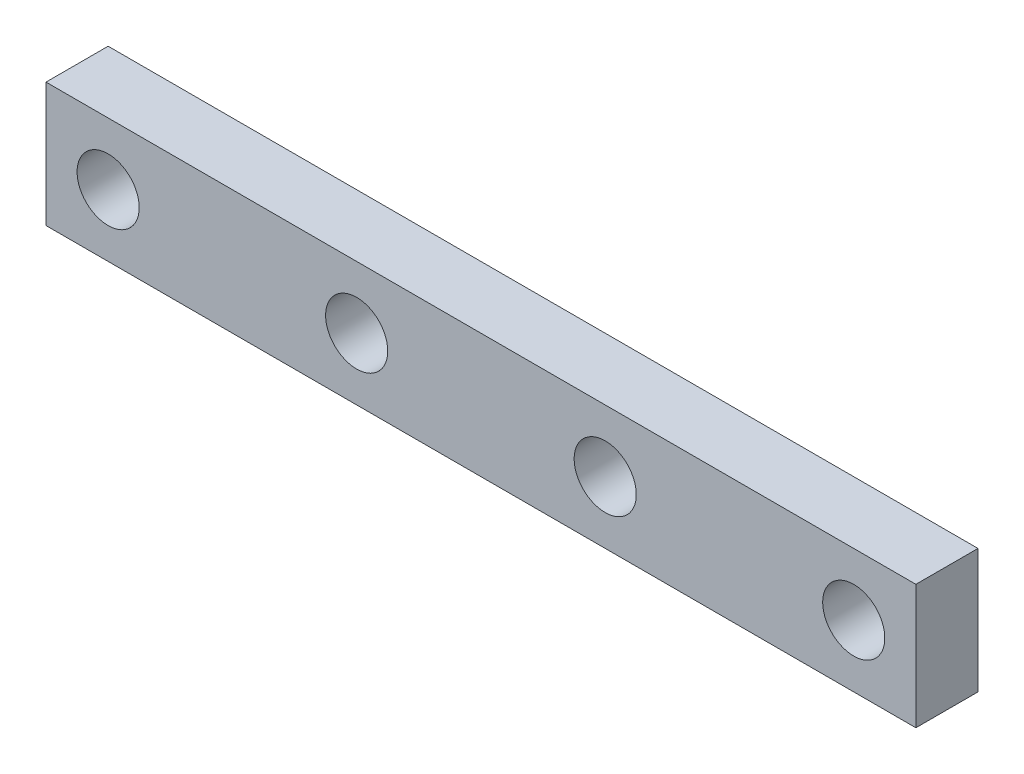
ISO-10303-21;
HEADER;
FILE_DESCRIPTION(('STEP AP214'),'2;1');
FILE_NAME('part.step','',(''),(''),'','','');
FILE_SCHEMA(('AUTOMOTIVE_DESIGN { 1 0 10303 214 1 1 1 1 }'));
ENDSEC;
DATA;
#1=APPLICATION_CONTEXT('core data for automotive mechanical design processes');
#2=APPLICATION_PROTOCOL_DEFINITION('international standard','automotive_design',2000,#1);
#3=PRODUCT_CONTEXT('',#1,'mechanical');
#4=PRODUCT('Part','Part','',(#3));
#5=PRODUCT_RELATED_PRODUCT_CATEGORY('part','',(#4));
#6=PRODUCT_DEFINITION_FORMATION('','',#4);
#7=PRODUCT_DEFINITION_CONTEXT('part definition',#1,'design');
#8=PRODUCT_DEFINITION('design','',#6,#7);
#9=PRODUCT_DEFINITION_SHAPE('','',#8);
#10=(LENGTH_UNIT() NAMED_UNIT(*) SI_UNIT(.MILLI.,.METRE.));
#11=(NAMED_UNIT(*) PLANE_ANGLE_UNIT() SI_UNIT($,.RADIAN.));
#12=(NAMED_UNIT(*) SI_UNIT($,.STERADIAN.) SOLID_ANGLE_UNIT());
#13=UNCERTAINTY_MEASURE_WITH_UNIT(LENGTH_MEASURE(1.E-05),#10,'distance_accuracy_value','');
#14=(GEOMETRIC_REPRESENTATION_CONTEXT(3) GLOBAL_UNCERTAINTY_ASSIGNED_CONTEXT((#13)) GLOBAL_UNIT_ASSIGNED_CONTEXT((#10,
#11,#12)) REPRESENTATION_CONTEXT('',''));
#15=CARTESIAN_POINT('',(0.,0.,0.));
#16=DIRECTION('',(0.,0.,1.));
#17=DIRECTION('',(1.,0.,0.));
#18=AXIS2_PLACEMENT_3D('',#15,#16,#17);
#19=CARTESIAN_POINT('',(22.225,-3.175,3.175));
#20=DIRECTION('',(-1.,0.,0.));
#21=DIRECTION('',(0.,0.,1.));
#22=AXIS2_PLACEMENT_3D('',#19,#20,#21);
#23=PLANE('',#22);
#24=DIRECTION('',(0.,1.,0.));
#25=VECTOR('',#24,1.);
#26=CARTESIAN_POINT('',(22.225,-3.175,0.));
#27=LINE('',#26,#25);
#28=CARTESIAN_POINT('',(22.225,-3.175,0.));
#29=VERTEX_POINT('',#28);
#30=CARTESIAN_POINT('',(22.225,3.175,0.));
#31=VERTEX_POINT('',#30);
#32=EDGE_CURVE('E111',#29,#31,#27,.T.);
#33=ORIENTED_EDGE('',*,*,#32,.T.);
#34=DIRECTION('',(0.,0.,-1.));
#35=VECTOR('',#34,1.);
#36=CARTESIAN_POINT('',(22.225,3.175,3.175));
#37=LINE('',#36,#35);
#38=CARTESIAN_POINT('',(22.225,3.175,3.175));
#39=VERTEX_POINT('',#38);
#40=EDGE_CURVE('E11',#39,#31,#37,.T.);
#41=ORIENTED_EDGE('',*,*,#40,.F.);
#42=DIRECTION('',(0.,1.,0.));
#43=VECTOR('',#42,1.);
#44=CARTESIAN_POINT('',(22.225,-3.175,3.175));
#45=LINE('',#44,#43);
#46=CARTESIAN_POINT('',(22.225,-3.175,3.175));
#47=VERTEX_POINT('',#46);
#48=EDGE_CURVE('E95',#47,#39,#45,.T.);
#49=ORIENTED_EDGE('',*,*,#48,.F.);
#50=DIRECTION('',(0.,0.,-1.));
#51=VECTOR('',#50,1.);
#52=CARTESIAN_POINT('',(22.225,-3.175,3.175));
#53=LINE('',#52,#51);
#54=EDGE_CURVE('E107',#47,#29,#53,.T.);
#55=ORIENTED_EDGE('',*,*,#54,.T.);
#56=EDGE_LOOP('',(#33,#41,#49,#55));
#57=FACE_BOUND('',#56,.T.);
#58=ADVANCED_FACE('F43',(#57),#23,.F.);
#59=CARTESIAN_POINT('',(-22.225,3.175,3.175));
#60=DIRECTION('',(0.,-1.,0.));
#61=DIRECTION('',(0.,0.,-1.));
#62=AXIS2_PLACEMENT_3D('',#59,#60,#61);
#63=PLANE('',#62);
#64=DIRECTION('',(-1.,0.,0.));
#65=VECTOR('',#64,1.);
#66=CARTESIAN_POINT('',(-22.225,3.175,0.));
#67=LINE('',#66,#65);
#68=CARTESIAN_POINT('',(-22.225,3.175,0.));
#69=VERTEX_POINT('',#68);
#70=EDGE_CURVE('E100',#31,#69,#67,.T.);
#71=ORIENTED_EDGE('',*,*,#70,.T.);
#72=DIRECTION('',(0.,0.,-1.));
#73=VECTOR('',#72,1.);
#74=CARTESIAN_POINT('',(-22.225,3.175,3.175));
#75=LINE('',#74,#73);
#76=CARTESIAN_POINT('',(-22.225,3.175,3.175));
#77=VERTEX_POINT('',#76);
#78=EDGE_CURVE('E52',#77,#69,#75,.T.);
#79=ORIENTED_EDGE('',*,*,#78,.F.);
#80=DIRECTION('',(-1.,0.,0.));
#81=VECTOR('',#80,1.);
#82=CARTESIAN_POINT('',(-22.225,3.175,3.175));
#83=LINE('',#82,#81);
#84=EDGE_CURVE('E90',#39,#77,#83,.T.);
#85=ORIENTED_EDGE('',*,*,#84,.F.);
#86=ORIENTED_EDGE('',*,*,#40,.T.);
#87=EDGE_LOOP('',(#71,#79,#85,#86));
#88=FACE_BOUND('',#87,.T.);
#89=ADVANCED_FACE('F99',(#88),#63,.F.);
#90=CARTESIAN_POINT('',(-22.225,-3.175,3.175));
#91=DIRECTION('',(1.,0.,0.));
#92=DIRECTION('',(0.,0.,-1.));
#93=AXIS2_PLACEMENT_3D('',#90,#91,#92);
#94=PLANE('',#93);
#95=DIRECTION('',(0.,-1.,0.));
#96=VECTOR('',#95,1.);
#97=CARTESIAN_POINT('',(-22.225,-3.175,0.));
#98=LINE('',#97,#96);
#99=CARTESIAN_POINT('',(-22.225,-3.175,0.));
#100=VERTEX_POINT('',#99);
#101=EDGE_CURVE('E77',#69,#100,#98,.T.);
#102=ORIENTED_EDGE('',*,*,#101,.T.);
#103=DIRECTION('',(0.,0.,-1.));
#104=VECTOR('',#103,1.);
#105=CARTESIAN_POINT('',(-22.225,-3.175,3.175));
#106=LINE('',#105,#104);
#107=CARTESIAN_POINT('',(-22.225,-3.175,3.175));
#108=VERTEX_POINT('',#107);
#109=EDGE_CURVE('E102',#108,#100,#106,.T.);
#110=ORIENTED_EDGE('',*,*,#109,.F.);
#111=DIRECTION('',(0.,-1.,0.));
#112=VECTOR('',#111,1.);
#113=CARTESIAN_POINT('',(-22.225,-3.175,3.175));
#114=LINE('',#113,#112);
#115=EDGE_CURVE('E93',#77,#108,#114,.T.);
#116=ORIENTED_EDGE('',*,*,#115,.F.);
#117=ORIENTED_EDGE('',*,*,#78,.T.);
#118=EDGE_LOOP('',(#102,#110,#116,#117));
#119=FACE_BOUND('',#118,.T.);
#120=ADVANCED_FACE('F103',(#119),#94,.F.);
#121=CARTESIAN_POINT('',(-22.225,-3.175,3.175));
#122=DIRECTION('',(0.,1.,0.));
#123=DIRECTION('',(0.,0.,1.));
#124=AXIS2_PLACEMENT_3D('',#121,#122,#123);
#125=PLANE('',#124);
#126=DIRECTION('',(1.,0.,0.));
#127=VECTOR('',#126,1.);
#128=CARTESIAN_POINT('',(-22.225,-3.175,0.));
#129=LINE('',#128,#127);
#130=EDGE_CURVE('E83',#100,#29,#129,.T.);
#131=ORIENTED_EDGE('',*,*,#130,.T.);
#132=ORIENTED_EDGE('',*,*,#54,.F.);
#133=DIRECTION('',(1.,0.,0.));
#134=VECTOR('',#133,1.);
#135=CARTESIAN_POINT('',(-22.225,-3.175,3.175));
#136=LINE('',#135,#134);
#137=EDGE_CURVE('E60',#108,#47,#136,.T.);
#138=ORIENTED_EDGE('',*,*,#137,.F.);
#139=ORIENTED_EDGE('',*,*,#109,.T.);
#140=EDGE_LOOP('',(#131,#132,#138,#139));
#141=FACE_BOUND('',#140,.T.);
#142=ADVANCED_FACE('F125',(#141),#125,.F.);
#143=CARTESIAN_POINT('',(0.,0.,3.175));
#144=DIRECTION('',(0.,0.,-1.));
#145=DIRECTION('',(-1.,0.,0.));
#146=AXIS2_PLACEMENT_3D('',#143,#144,#145);
#147=PLANE('',#146);
#148=CARTESIAN_POINT('',(6.35,0.,3.175));
#149=DIRECTION('',(0.,0.,-1.));
#150=DIRECTION('',(-1.,0.,0.));
#151=AXIS2_PLACEMENT_3D('',#148,#149,#150);
#152=CIRCLE('',#151,1.5875);
#153=CARTESIAN_POINT('',(4.7625,0.,3.175));
#154=VERTEX_POINT('',#153);
#155=EDGE_CURVE('E156',#154,#154,#152,.T.);
#156=ORIENTED_EDGE('',*,*,#155,.T.);
#157=EDGE_LOOP('',(#156));
#158=FACE_BOUND('',#157,.T.);
#159=CARTESIAN_POINT('',(19.05,0.,3.175));
#160=DIRECTION('',(0.,0.,-1.));
#161=DIRECTION('',(-1.,0.,0.));
#162=AXIS2_PLACEMENT_3D('',#159,#160,#161);
#163=CIRCLE('',#162,1.5875);
#164=CARTESIAN_POINT('',(17.4625,0.,3.175));
#165=VERTEX_POINT('',#164);
#166=EDGE_CURVE('E148',#165,#165,#163,.T.);
#167=ORIENTED_EDGE('',*,*,#166,.T.);
#168=EDGE_LOOP('',(#167));
#169=FACE_BOUND('',#168,.T.);
#170=CARTESIAN_POINT('',(-6.35,0.,3.175));
#171=DIRECTION('',(0.,0.,1.));
#172=DIRECTION('',(1.,0.,0.));
#173=AXIS2_PLACEMENT_3D('',#170,#171,#172);
#174=CIRCLE('',#173,1.5875);
#175=CARTESIAN_POINT('',(-4.7625,0.,3.175));
#176=VERTEX_POINT('',#175);
#177=EDGE_CURVE('E141',#176,#176,#174,.T.);
#178=ORIENTED_EDGE('',*,*,#177,.F.);
#179=EDGE_LOOP('',(#178));
#180=FACE_BOUND('',#179,.T.);
#181=CARTESIAN_POINT('',(-19.05,0.,3.175));
#182=DIRECTION('',(0.,0.,1.));
#183=DIRECTION('',(1.,0.,0.));
#184=AXIS2_PLACEMENT_3D('',#181,#182,#183);
#185=CIRCLE('',#184,1.5875);
#186=CARTESIAN_POINT('',(-17.4625,0.,3.175));
#187=VERTEX_POINT('',#186);
#188=EDGE_CURVE('E136',#187,#187,#185,.T.);
#189=ORIENTED_EDGE('',*,*,#188,.F.);
#190=EDGE_LOOP('',(#189));
#191=FACE_BOUND('',#190,.T.);
#192=ORIENTED_EDGE('',*,*,#48,.T.);
#193=ORIENTED_EDGE('',*,*,#84,.T.);
#194=ORIENTED_EDGE('',*,*,#115,.T.);
#195=ORIENTED_EDGE('',*,*,#137,.T.);
#196=EDGE_LOOP('',(#192,#193,#194,#195));
#197=FACE_BOUND('',#196,.T.);
#198=ADVANCED_FACE('F91',(#158,#169,#180,#191,#197),#147,.F.);
#199=CARTESIAN_POINT('',(0.,0.,0.));
#200=DIRECTION('',(0.,0.,-1.));
#201=DIRECTION('',(-1.,0.,0.));
#202=AXIS2_PLACEMENT_3D('',#199,#200,#201);
#203=PLANE('',#202);
#204=CARTESIAN_POINT('',(6.35,0.,0.));
#205=DIRECTION('',(0.,0.,-1.));
#206=DIRECTION('',(-1.,0.,0.));
#207=AXIS2_PLACEMENT_3D('',#204,#205,#206);
#208=CIRCLE('',#207,1.5875);
#209=CARTESIAN_POINT('',(4.7625,0.,0.));
#210=VERTEX_POINT('',#209);
#211=EDGE_CURVE('E137',#210,#210,#208,.T.);
#212=ORIENTED_EDGE('',*,*,#211,.F.);
#213=EDGE_LOOP('',(#212));
#214=FACE_BOUND('',#213,.T.);
#215=CARTESIAN_POINT('',(19.05,0.,0.));
#216=DIRECTION('',(0.,0.,-1.));
#217=DIRECTION('',(-1.,0.,0.));
#218=AXIS2_PLACEMENT_3D('',#215,#216,#217);
#219=CIRCLE('',#218,1.5875);
#220=CARTESIAN_POINT('',(17.4625,0.,0.));
#221=VERTEX_POINT('',#220);
#222=EDGE_CURVE('E152',#221,#221,#219,.T.);
#223=ORIENTED_EDGE('',*,*,#222,.F.);
#224=EDGE_LOOP('',(#223));
#225=FACE_BOUND('',#224,.T.);
#226=CARTESIAN_POINT('',(-6.35,0.,0.));
#227=DIRECTION('',(0.,0.,1.));
#228=DIRECTION('',(1.,0.,0.));
#229=AXIS2_PLACEMENT_3D('',#226,#227,#228);
#230=CIRCLE('',#229,1.5875);
#231=CARTESIAN_POINT('',(-4.7625,0.,0.));
#232=VERTEX_POINT('',#231);
#233=EDGE_CURVE('E115',#232,#232,#230,.T.);
#234=ORIENTED_EDGE('',*,*,#233,.T.);
#235=EDGE_LOOP('',(#234));
#236=FACE_BOUND('',#235,.T.);
#237=CARTESIAN_POINT('',(-19.05,0.,0.));
#238=DIRECTION('',(0.,0.,1.));
#239=DIRECTION('',(1.,0.,0.));
#240=AXIS2_PLACEMENT_3D('',#237,#238,#239);
#241=CIRCLE('',#240,1.5875);
#242=CARTESIAN_POINT('',(-17.4625,0.,0.));
#243=VERTEX_POINT('',#242);
#244=EDGE_CURVE('E132',#243,#243,#241,.T.);
#245=ORIENTED_EDGE('',*,*,#244,.T.);
#246=EDGE_LOOP('',(#245));
#247=FACE_BOUND('',#246,.T.);
#248=ORIENTED_EDGE('',*,*,#32,.F.);
#249=ORIENTED_EDGE('',*,*,#130,.F.);
#250=ORIENTED_EDGE('',*,*,#101,.F.);
#251=ORIENTED_EDGE('',*,*,#70,.F.);
#252=EDGE_LOOP('',(#248,#249,#250,#251));
#253=FACE_BOUND('',#252,.T.);
#254=ADVANCED_FACE('F128',(#214,#225,#236,#247,#253),#203,.T.);
#255=CARTESIAN_POINT('',(-19.05,0.,0.));
#256=DIRECTION('',(0.,0.,1.));
#257=DIRECTION('',(1.,0.,0.));
#258=AXIS2_PLACEMENT_3D('',#255,#256,#257);
#259=CYLINDRICAL_SURFACE('',#258,1.5875);
#260=ORIENTED_EDGE('',*,*,#244,.F.);
#261=EDGE_LOOP('',(#260));
#262=FACE_BOUND('',#261,.T.);
#263=ORIENTED_EDGE('',*,*,#188,.T.);
#264=EDGE_LOOP('',(#263));
#265=FACE_BOUND('',#264,.T.);
#266=ADVANCED_FACE('F169',(#262,#265),#259,.F.);
#267=CARTESIAN_POINT('',(-6.35,0.,0.));
#268=DIRECTION('',(0.,0.,1.));
#269=DIRECTION('',(1.,0.,0.));
#270=AXIS2_PLACEMENT_3D('',#267,#268,#269);
#271=CYLINDRICAL_SURFACE('',#270,1.5875);
#272=ORIENTED_EDGE('',*,*,#233,.F.);
#273=EDGE_LOOP('',(#272));
#274=FACE_BOUND('',#273,.T.);
#275=ORIENTED_EDGE('',*,*,#177,.T.);
#276=EDGE_LOOP('',(#275));
#277=FACE_BOUND('',#276,.T.);
#278=ADVANCED_FACE('F179',(#274,#277),#271,.F.);
#279=CARTESIAN_POINT('',(19.05,0.,0.));
#280=DIRECTION('',(0.,0.,1.));
#281=DIRECTION('',(1.,0.,0.));
#282=AXIS2_PLACEMENT_3D('',#279,#280,#281);
#283=CYLINDRICAL_SURFACE('',#282,1.5875);
#284=ORIENTED_EDGE('',*,*,#222,.T.);
#285=EDGE_LOOP('',(#284));
#286=FACE_BOUND('',#285,.T.);
#287=ORIENTED_EDGE('',*,*,#166,.F.);
#288=EDGE_LOOP('',(#287));
#289=FACE_BOUND('',#288,.T.);
#290=ADVANCED_FACE('F223',(#286,#289),#283,.F.);
#291=CARTESIAN_POINT('',(6.35,0.,0.));
#292=DIRECTION('',(0.,0.,1.));
#293=DIRECTION('',(1.,0.,0.));
#294=AXIS2_PLACEMENT_3D('',#291,#292,#293);
#295=CYLINDRICAL_SURFACE('',#294,1.5875);
#296=ORIENTED_EDGE('',*,*,#211,.T.);
#297=EDGE_LOOP('',(#296));
#298=FACE_BOUND('',#297,.T.);
#299=ORIENTED_EDGE('',*,*,#155,.F.);
#300=EDGE_LOOP('',(#299));
#301=FACE_BOUND('',#300,.T.);
#302=ADVANCED_FACE('F164',(#298,#301),#295,.F.);
#303=CLOSED_SHELL('',(#58,#89,#120,#142,#198,#254,#266,#278,#290,#302));
#304=MANIFOLD_SOLID_BREP('B2',#303);
#305=ADVANCED_BREP_SHAPE_REPRESENTATION('',(#18,#304),#14);
#306=SHAPE_DEFINITION_REPRESENTATION(#9,#305);
ENDSEC;
END-ISO-10303-21;
